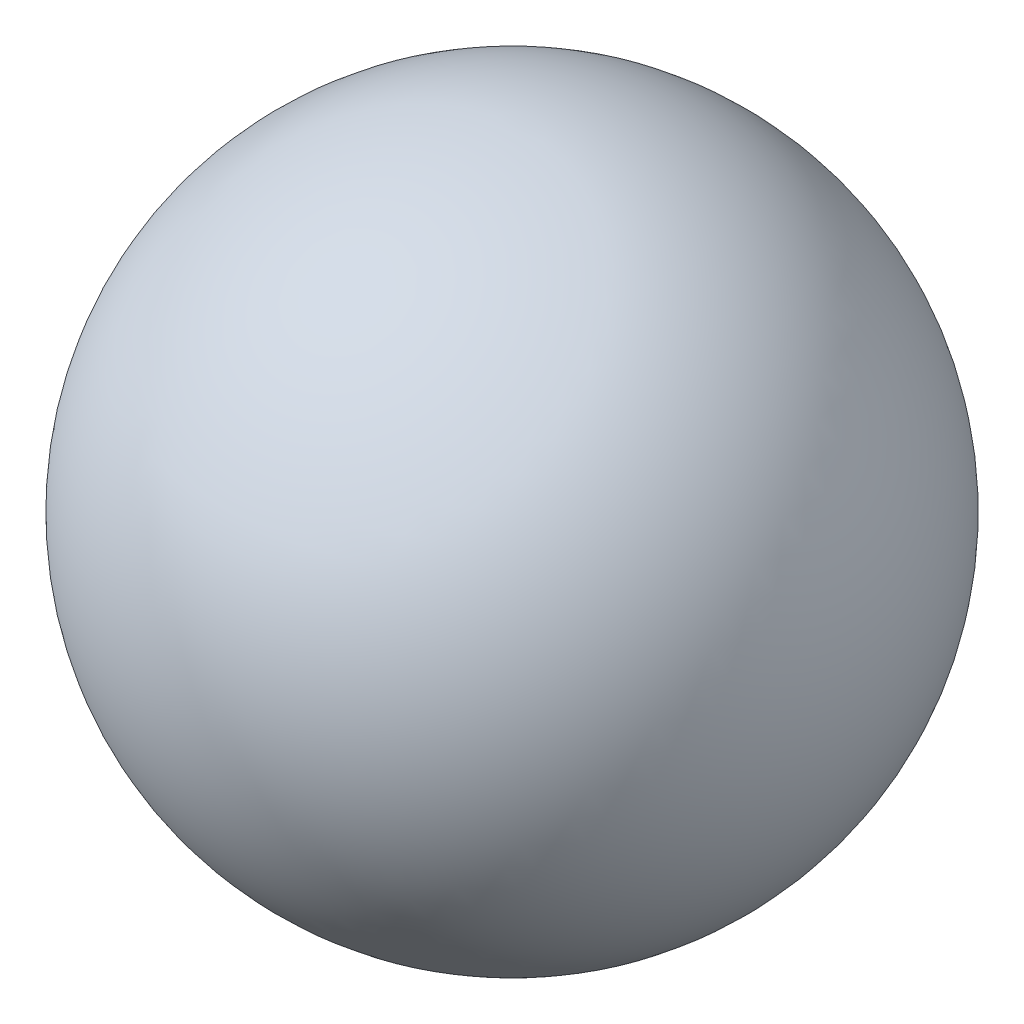
ISO-10303-21;
HEADER;
FILE_DESCRIPTION(('STEP AP214'),'2;1');
FILE_NAME('part.step','',(''),(''),'','','');
FILE_SCHEMA(('AUTOMOTIVE_DESIGN { 1 0 10303 214 1 1 1 1 }'));
ENDSEC;
DATA;
#1=APPLICATION_CONTEXT('core data for automotive mechanical design processes');
#2=APPLICATION_PROTOCOL_DEFINITION('international standard','automotive_design',2000,#1);
#3=PRODUCT_CONTEXT('',#1,'mechanical');
#4=PRODUCT('Part','Part','',(#3));
#5=PRODUCT_RELATED_PRODUCT_CATEGORY('part','',(#4));
#6=PRODUCT_DEFINITION_FORMATION('','',#4);
#7=PRODUCT_DEFINITION_CONTEXT('part definition',#1,'design');
#8=PRODUCT_DEFINITION('design','',#6,#7);
#9=PRODUCT_DEFINITION_SHAPE('','',#8);
#10=(LENGTH_UNIT() NAMED_UNIT(*) SI_UNIT(.MILLI.,.METRE.));
#11=(NAMED_UNIT(*) PLANE_ANGLE_UNIT() SI_UNIT($,.RADIAN.));
#12=(NAMED_UNIT(*) SI_UNIT($,.STERADIAN.) SOLID_ANGLE_UNIT());
#13=UNCERTAINTY_MEASURE_WITH_UNIT(LENGTH_MEASURE(1.E-05),#10,'distance_accuracy_value','');
#14=(GEOMETRIC_REPRESENTATION_CONTEXT(3) GLOBAL_UNCERTAINTY_ASSIGNED_CONTEXT((#13)) GLOBAL_UNIT_ASSIGNED_CONTEXT((#10,
#11,#12)) REPRESENTATION_CONTEXT('',''));
#15=CARTESIAN_POINT('',(0.,0.,0.));
#16=DIRECTION('',(0.,0.,1.));
#17=DIRECTION('',(1.,0.,0.));
#18=AXIS2_PLACEMENT_3D('',#15,#16,#17);
#19=CARTESIAN_POINT('',(0.,0.,0.));
#20=DIRECTION('',(0.,1.,0.));
#21=DIRECTION('',(1.,0.,0.));
#22=AXIS2_PLACEMENT_3D('',#19,#20,#21);
#23=SPHERICAL_SURFACE('',#22,11.11);
#24=CARTESIAN_POINT('',(0.,11.11,0.));
#25=VERTEX_POINT('',#24);
#26=VERTEX_LOOP('',#25);
#27=FACE_BOUND('',#26,.T.);
#28=ADVANCED_FACE('F28',(#27),#23,.T.);
#29=CLOSED_SHELL('',(#28));
#30=MANIFOLD_SOLID_BREP('B2',#29);
#31=ADVANCED_BREP_SHAPE_REPRESENTATION('',(#18,#30),#14);
#32=SHAPE_DEFINITION_REPRESENTATION(#9,#31);
ENDSEC;
END-ISO-10303-21;
